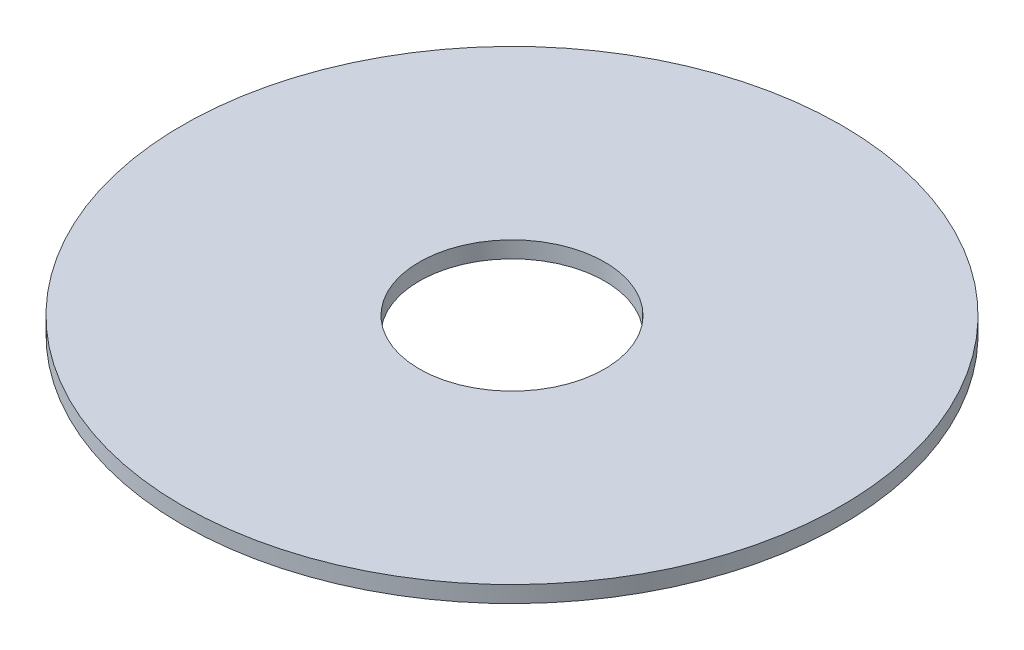
ISO-10303-21;
HEADER;
FILE_DESCRIPTION(('STEP AP214'),'2;1');
FILE_NAME('part.step','',(''),(''),'','','');
FILE_SCHEMA(('AUTOMOTIVE_DESIGN { 1 0 10303 214 1 1 1 1 }'));
ENDSEC;
DATA;
#1=APPLICATION_CONTEXT('core data for automotive mechanical design processes');
#2=APPLICATION_PROTOCOL_DEFINITION('international standard','automotive_design',2000,#1);
#3=PRODUCT_CONTEXT('',#1,'mechanical');
#4=PRODUCT('Part','Part','',(#3));
#5=PRODUCT_RELATED_PRODUCT_CATEGORY('part','',(#4));
#6=PRODUCT_DEFINITION_FORMATION('','',#4);
#7=PRODUCT_DEFINITION_CONTEXT('part definition',#1,'design');
#8=PRODUCT_DEFINITION('design','',#6,#7);
#9=PRODUCT_DEFINITION_SHAPE('','',#8);
#10=(LENGTH_UNIT() NAMED_UNIT(*) SI_UNIT(.MILLI.,.METRE.));
#11=(NAMED_UNIT(*) PLANE_ANGLE_UNIT() SI_UNIT($,.RADIAN.));
#12=(NAMED_UNIT(*) SI_UNIT($,.STERADIAN.) SOLID_ANGLE_UNIT());
#13=UNCERTAINTY_MEASURE_WITH_UNIT(LENGTH_MEASURE(1.E-05),#10,'distance_accuracy_value','');
#14=(GEOMETRIC_REPRESENTATION_CONTEXT(3) GLOBAL_UNCERTAINTY_ASSIGNED_CONTEXT((#13)) GLOBAL_UNIT_ASSIGNED_CONTEXT((#10,
#11,#12)) REPRESENTATION_CONTEXT('',''));
#15=CARTESIAN_POINT('',(0.,0.,0.));
#16=DIRECTION('',(0.,0.,1.));
#17=DIRECTION('',(1.,0.,0.));
#18=AXIS2_PLACEMENT_3D('',#15,#16,#17);
#19=CARTESIAN_POINT('',(0.,4.,0.));
#20=DIRECTION('',(0.,-1.,0.));
#21=DIRECTION('',(0.,0.,-1.));
#22=AXIS2_PLACEMENT_3D('',#19,#20,#21);
#23=CYLINDRICAL_SURFACE('',#22,80.);
#24=CARTESIAN_POINT('',(0.,4.,0.));
#25=DIRECTION('',(0.,1.,0.));
#26=DIRECTION('',(0.,0.,1.));
#27=AXIS2_PLACEMENT_3D('',#24,#25,#26);
#28=CIRCLE('',#27,80.);
#29=CARTESIAN_POINT('',(0.,4.,80.));
#30=VERTEX_POINT('',#29);
#31=EDGE_CURVE('E10',#30,#30,#28,.T.);
#32=ORIENTED_EDGE('',*,*,#31,.F.);
#33=EDGE_LOOP('',(#32));
#34=FACE_BOUND('',#33,.T.);
#35=CARTESIAN_POINT('',(0.,0.,0.));
#36=DIRECTION('',(0.,1.,0.));
#37=DIRECTION('',(0.,0.,1.));
#38=AXIS2_PLACEMENT_3D('',#35,#36,#37);
#39=CIRCLE('',#38,80.);
#40=CARTESIAN_POINT('',(0.,0.,80.));
#41=VERTEX_POINT('',#40);
#42=EDGE_CURVE('E37',#41,#41,#39,.T.);
#43=ORIENTED_EDGE('',*,*,#42,.T.);
#44=EDGE_LOOP('',(#43));
#45=FACE_BOUND('',#44,.T.);
#46=ADVANCED_FACE('F40',(#34,#45),#23,.T.);
#47=CARTESIAN_POINT('',(0.,4.,0.));
#48=DIRECTION('',(0.,1.,0.));
#49=DIRECTION('',(0.,0.,1.));
#50=AXIS2_PLACEMENT_3D('',#47,#48,#49);
#51=PLANE('',#50);
#52=CARTESIAN_POINT('',(0.,4.,0.));
#53=DIRECTION('',(0.,1.,0.));
#54=DIRECTION('',(0.,0.,1.));
#55=AXIS2_PLACEMENT_3D('',#52,#53,#54);
#56=CIRCLE('',#55,22.5);
#57=CARTESIAN_POINT('',(0.,4.,22.5));
#58=VERTEX_POINT('',#57);
#59=EDGE_CURVE('E50',#58,#58,#56,.T.);
#60=ORIENTED_EDGE('',*,*,#59,.F.);
#61=EDGE_LOOP('',(#60));
#62=FACE_BOUND('',#61,.T.);
#63=ORIENTED_EDGE('',*,*,#31,.T.);
#64=EDGE_LOOP('',(#63));
#65=FACE_BOUND('',#64,.T.);
#66=ADVANCED_FACE('F59',(#62,#65),#51,.T.);
#67=CARTESIAN_POINT('',(0.,0.,0.));
#68=DIRECTION('',(0.,1.,0.));
#69=DIRECTION('',(0.,0.,1.));
#70=AXIS2_PLACEMENT_3D('',#67,#68,#69);
#71=PLANE('',#70);
#72=CARTESIAN_POINT('',(0.,0.,0.));
#73=DIRECTION('',(0.,1.,0.));
#74=DIRECTION('',(0.,0.,1.));
#75=AXIS2_PLACEMENT_3D('',#72,#73,#74);
#76=CIRCLE('',#75,22.5);
#77=CARTESIAN_POINT('',(0.,0.,22.5));
#78=VERTEX_POINT('',#77);
#79=EDGE_CURVE('E47',#78,#78,#76,.T.);
#80=ORIENTED_EDGE('',*,*,#79,.T.);
#81=EDGE_LOOP('',(#80));
#82=FACE_BOUND('',#81,.T.);
#83=ORIENTED_EDGE('',*,*,#42,.F.);
#84=EDGE_LOOP('',(#83));
#85=FACE_BOUND('',#84,.T.);
#86=ADVANCED_FACE('F58',(#82,#85),#71,.F.);
#87=CARTESIAN_POINT('',(0.,4.,0.));
#88=DIRECTION('',(0.,-1.,0.));
#89=DIRECTION('',(0.,0.,-1.));
#90=AXIS2_PLACEMENT_3D('',#87,#88,#89);
#91=CYLINDRICAL_SURFACE('',#90,22.5);
#92=ORIENTED_EDGE('',*,*,#59,.T.);
#93=EDGE_LOOP('',(#92));
#94=FACE_BOUND('',#93,.T.);
#95=ORIENTED_EDGE('',*,*,#79,.F.);
#96=EDGE_LOOP('',(#95));
#97=FACE_BOUND('',#96,.T.);
#98=ADVANCED_FACE('F54',(#94,#97),#91,.F.);
#99=CLOSED_SHELL('',(#46,#66,#86,#98));
#100=MANIFOLD_SOLID_BREP('B2',#99);
#101=ADVANCED_BREP_SHAPE_REPRESENTATION('',(#18,#100),#14);
#102=SHAPE_DEFINITION_REPRESENTATION(#9,#101);
ENDSEC;
END-ISO-10303-21;
